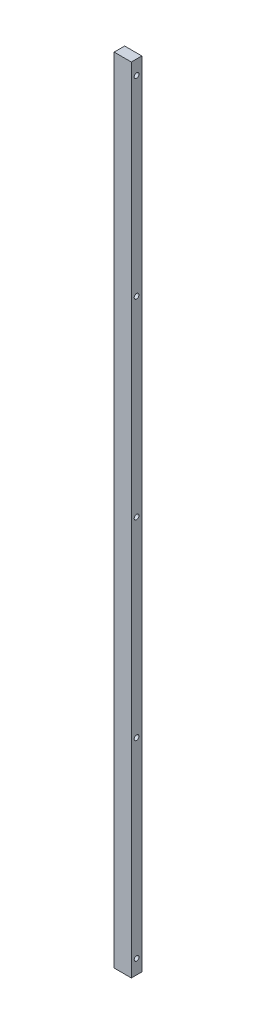
ISO-10303-21;
HEADER;
FILE_DESCRIPTION(('STEP AP214'),'2;1');
FILE_NAME('part.step','',(''),(''),'','','');
FILE_SCHEMA(('AUTOMOTIVE_DESIGN { 1 0 10303 214 1 1 1 1 }'));
ENDSEC;
DATA;
#1=APPLICATION_CONTEXT('core data for automotive mechanical design processes');
#2=APPLICATION_PROTOCOL_DEFINITION('international standard','automotive_design',2000,#1);
#3=PRODUCT_CONTEXT('',#1,'mechanical');
#4=PRODUCT('Part','Part','',(#3));
#5=PRODUCT_RELATED_PRODUCT_CATEGORY('part','',(#4));
#6=PRODUCT_DEFINITION_FORMATION('','',#4);
#7=PRODUCT_DEFINITION_CONTEXT('part definition',#1,'design');
#8=PRODUCT_DEFINITION('design','',#6,#7);
#9=PRODUCT_DEFINITION_SHAPE('','',#8);
#10=(LENGTH_UNIT() NAMED_UNIT(*) SI_UNIT(.MILLI.,.METRE.));
#11=(NAMED_UNIT(*) PLANE_ANGLE_UNIT() SI_UNIT($,.RADIAN.));
#12=(NAMED_UNIT(*) SI_UNIT($,.STERADIAN.) SOLID_ANGLE_UNIT());
#13=UNCERTAINTY_MEASURE_WITH_UNIT(LENGTH_MEASURE(1.E-05),#10,'distance_accuracy_value','');
#14=(GEOMETRIC_REPRESENTATION_CONTEXT(3) GLOBAL_UNCERTAINTY_ASSIGNED_CONTEXT((#13)) GLOBAL_UNIT_ASSIGNED_CONTEXT((#10,
#11,#12)) REPRESENTATION_CONTEXT('',''));
#15=CARTESIAN_POINT('',(0.,0.,0.));
#16=DIRECTION('',(0.,0.,1.));
#17=DIRECTION('',(1.,0.,0.));
#18=AXIS2_PLACEMENT_3D('',#15,#16,#17);
#19=CARTESIAN_POINT('',(9.,-415.,5.5));
#20=DIRECTION('',(-1.,0.,0.));
#21=DIRECTION('',(0.,0.,1.));
#22=AXIS2_PLACEMENT_3D('',#19,#20,#21);
#23=PLANE('',#22);
#24=CARTESIAN_POINT('',(9.,-400.,0.));
#25=DIRECTION('',(1.,0.,0.));
#26=DIRECTION('',(0.,0.,-1.));
#27=AXIS2_PLACEMENT_3D('',#24,#25,#26);
#28=CIRCLE('',#27,2.5);
#29=CARTESIAN_POINT('',(9.,-400.,-2.5));
#30=VERTEX_POINT('',#29);
#31=EDGE_CURVE('E124',#30,#30,#28,.T.);
#32=ORIENTED_EDGE('',*,*,#31,.F.);
#33=EDGE_LOOP('',(#32));
#34=FACE_BOUND('',#33,.T.);
#35=CARTESIAN_POINT('',(9.,-200.,0.));
#36=DIRECTION('',(1.,0.,0.));
#37=DIRECTION('',(0.,0.,-1.));
#38=AXIS2_PLACEMENT_3D('',#35,#36,#37);
#39=CIRCLE('',#38,2.5);
#40=CARTESIAN_POINT('',(9.,-200.,-2.50000000000003));
#41=VERTEX_POINT('',#40);
#42=EDGE_CURVE('E123',#41,#41,#39,.T.);
#43=ORIENTED_EDGE('',*,*,#42,.F.);
#44=EDGE_LOOP('',(#43));
#45=FACE_BOUND('',#44,.T.);
#46=CARTESIAN_POINT('',(9.,0.,0.));
#47=DIRECTION('',(1.,0.,0.));
#48=DIRECTION('',(0.,0.,-1.));
#49=AXIS2_PLACEMENT_3D('',#46,#47,#48);
#50=CIRCLE('',#49,2.49999999999999);
#51=CARTESIAN_POINT('',(9.,0.,-2.49999999999999));
#52=VERTEX_POINT('',#51);
#53=EDGE_CURVE('E134',#52,#52,#50,.T.);
#54=ORIENTED_EDGE('',*,*,#53,.F.);
#55=EDGE_LOOP('',(#54));
#56=FACE_BOUND('',#55,.T.);
#57=CARTESIAN_POINT('',(9.,200.,0.));
#58=DIRECTION('',(1.,0.,0.));
#59=DIRECTION('',(0.,0.,-1.));
#60=AXIS2_PLACEMENT_3D('',#57,#58,#59);
#61=CIRCLE('',#60,2.5);
#62=CARTESIAN_POINT('',(9.,200.,-2.50000000000003));
#63=VERTEX_POINT('',#62);
#64=EDGE_CURVE('E140',#63,#63,#61,.T.);
#65=ORIENTED_EDGE('',*,*,#64,.F.);
#66=EDGE_LOOP('',(#65));
#67=FACE_BOUND('',#66,.T.);
#68=CARTESIAN_POINT('',(9.,400.,0.));
#69=DIRECTION('',(1.,0.,0.));
#70=DIRECTION('',(0.,0.,-1.));
#71=AXIS2_PLACEMENT_3D('',#68,#69,#70);
#72=CIRCLE('',#71,2.5);
#73=CARTESIAN_POINT('',(9.,400.,-2.5));
#74=VERTEX_POINT('',#73);
#75=EDGE_CURVE('E146',#74,#74,#72,.T.);
#76=ORIENTED_EDGE('',*,*,#75,.F.);
#77=EDGE_LOOP('',(#76));
#78=FACE_BOUND('',#77,.T.);
#79=DIRECTION('',(0.,1.,0.));
#80=VECTOR('',#79,1.);
#81=CARTESIAN_POINT('',(9.,-415.,-5.5));
#82=LINE('',#81,#80);
#83=CARTESIAN_POINT('',(9.,-415.,-5.5));
#84=VERTEX_POINT('',#83);
#85=CARTESIAN_POINT('',(9.,415.,-5.5));
#86=VERTEX_POINT('',#85);
#87=EDGE_CURVE('E152',#84,#86,#82,.T.);
#88=ORIENTED_EDGE('',*,*,#87,.T.);
#89=DIRECTION('',(0.,0.,-1.));
#90=VECTOR('',#89,1.);
#91=CARTESIAN_POINT('',(9.,415.,5.5));
#92=LINE('',#91,#90);
#93=CARTESIAN_POINT('',(9.,415.,5.5));
#94=VERTEX_POINT('',#93);
#95=EDGE_CURVE('E13',#94,#86,#92,.T.);
#96=ORIENTED_EDGE('',*,*,#95,.F.);
#97=DIRECTION('',(0.,1.,0.));
#98=VECTOR('',#97,1.);
#99=CARTESIAN_POINT('',(9.,-415.,5.5));
#100=LINE('',#99,#98);
#101=CARTESIAN_POINT('',(9.,-415.,5.5));
#102=VERTEX_POINT('',#101);
#103=EDGE_CURVE('E153',#102,#94,#100,.T.);
#104=ORIENTED_EDGE('',*,*,#103,.F.);
#105=DIRECTION('',(0.,0.,-1.));
#106=VECTOR('',#105,1.);
#107=CARTESIAN_POINT('',(9.,-415.,5.5));
#108=LINE('',#107,#106);
#109=EDGE_CURVE('E159',#102,#84,#108,.T.);
#110=ORIENTED_EDGE('',*,*,#109,.T.);
#111=EDGE_LOOP('',(#88,#96,#104,#110));
#112=FACE_BOUND('',#111,.T.);
#113=ADVANCED_FACE('F50',(#34,#45,#56,#67,#78,#112),#23,.F.);
#114=CARTESIAN_POINT('',(-9.,415.,5.5));
#115=DIRECTION('',(0.,-1.,0.));
#116=DIRECTION('',(0.,0.,-1.));
#117=AXIS2_PLACEMENT_3D('',#114,#115,#116);
#118=PLANE('',#117);
#119=DIRECTION('',(-1.,0.,0.));
#120=VECTOR('',#119,1.);
#121=CARTESIAN_POINT('',(-9.,415.,-5.5));
#122=LINE('',#121,#120);
#123=CARTESIAN_POINT('',(-9.,415.,-5.5));
#124=VERTEX_POINT('',#123);
#125=EDGE_CURVE('E162',#86,#124,#122,.T.);
#126=ORIENTED_EDGE('',*,*,#125,.T.);
#127=DIRECTION('',(0.,0.,-1.));
#128=VECTOR('',#127,1.);
#129=CARTESIAN_POINT('',(-9.,415.,5.5));
#130=LINE('',#129,#128);
#131=CARTESIAN_POINT('',(-9.,415.,5.5));
#132=VERTEX_POINT('',#131);
#133=EDGE_CURVE('E58',#132,#124,#130,.T.);
#134=ORIENTED_EDGE('',*,*,#133,.F.);
#135=DIRECTION('',(-1.,0.,0.));
#136=VECTOR('',#135,1.);
#137=CARTESIAN_POINT('',(-9.,415.,5.5));
#138=LINE('',#137,#136);
#139=EDGE_CURVE('E97',#94,#132,#138,.T.);
#140=ORIENTED_EDGE('',*,*,#139,.F.);
#141=ORIENTED_EDGE('',*,*,#95,.T.);
#142=EDGE_LOOP('',(#126,#134,#140,#141));
#143=FACE_BOUND('',#142,.T.);
#144=ADVANCED_FACE('F185',(#143),#118,.F.);
#145=CARTESIAN_POINT('',(-9.,-415.,5.5));
#146=DIRECTION('',(1.,0.,0.));
#147=DIRECTION('',(0.,0.,-1.));
#148=AXIS2_PLACEMENT_3D('',#145,#146,#147);
#149=PLANE('',#148);
#150=DIRECTION('',(0.,-1.,0.));
#151=VECTOR('',#150,1.);
#152=CARTESIAN_POINT('',(-9.,-415.,-5.5));
#153=LINE('',#152,#151);
#154=CARTESIAN_POINT('',(-9.,-415.,-5.5));
#155=VERTEX_POINT('',#154);
#156=EDGE_CURVE('E84',#124,#155,#153,.T.);
#157=ORIENTED_EDGE('',*,*,#156,.T.);
#158=DIRECTION('',(0.,0.,-1.));
#159=VECTOR('',#158,1.);
#160=CARTESIAN_POINT('',(-9.,-415.,5.5));
#161=LINE('',#160,#159);
#162=CARTESIAN_POINT('',(-9.,-415.,5.5));
#163=VERTEX_POINT('',#162);
#164=EDGE_CURVE('E167',#163,#155,#161,.T.);
#165=ORIENTED_EDGE('',*,*,#164,.F.);
#166=DIRECTION('',(0.,-1.,0.));
#167=VECTOR('',#166,1.);
#168=CARTESIAN_POINT('',(-9.,-415.,5.5));
#169=LINE('',#168,#167);
#170=EDGE_CURVE('E156',#132,#163,#169,.T.);
#171=ORIENTED_EDGE('',*,*,#170,.F.);
#172=ORIENTED_EDGE('',*,*,#133,.T.);
#173=EDGE_LOOP('',(#157,#165,#171,#172));
#174=FACE_BOUND('',#173,.T.);
#175=ADVANCED_FACE('F169',(#174),#149,.F.);
#176=CARTESIAN_POINT('',(-9.,-415.,5.5));
#177=DIRECTION('',(0.,1.,0.));
#178=DIRECTION('',(0.,0.,1.));
#179=AXIS2_PLACEMENT_3D('',#176,#177,#178);
#180=PLANE('',#179);
#181=DIRECTION('',(1.,0.,0.));
#182=VECTOR('',#181,1.);
#183=CARTESIAN_POINT('',(-9.,-415.,-5.5));
#184=LINE('',#183,#182);
#185=EDGE_CURVE('E90',#155,#84,#184,.T.);
#186=ORIENTED_EDGE('',*,*,#185,.T.);
#187=ORIENTED_EDGE('',*,*,#109,.F.);
#188=DIRECTION('',(1.,0.,0.));
#189=VECTOR('',#188,1.);
#190=CARTESIAN_POINT('',(-9.,-415.,5.5));
#191=LINE('',#190,#189);
#192=EDGE_CURVE('E66',#163,#102,#191,.T.);
#193=ORIENTED_EDGE('',*,*,#192,.F.);
#194=ORIENTED_EDGE('',*,*,#164,.T.);
#195=EDGE_LOOP('',(#186,#187,#193,#194));
#196=FACE_BOUND('',#195,.T.);
#197=ADVANCED_FACE('F176',(#196),#180,.F.);
#198=CARTESIAN_POINT('',(0.,0.,5.5));
#199=DIRECTION('',(0.,0.,-1.));
#200=DIRECTION('',(-1.,0.,0.));
#201=AXIS2_PLACEMENT_3D('',#198,#199,#200);
#202=PLANE('',#201);
#203=ORIENTED_EDGE('',*,*,#103,.T.);
#204=ORIENTED_EDGE('',*,*,#139,.T.);
#205=ORIENTED_EDGE('',*,*,#170,.T.);
#206=ORIENTED_EDGE('',*,*,#192,.T.);
#207=EDGE_LOOP('',(#203,#204,#205,#206));
#208=FACE_BOUND('',#207,.T.);
#209=ADVANCED_FACE('F178',(#208),#202,.F.);
#210=CARTESIAN_POINT('',(0.,0.,-5.5));
#211=DIRECTION('',(0.,0.,-1.));
#212=DIRECTION('',(-1.,0.,0.));
#213=AXIS2_PLACEMENT_3D('',#210,#211,#212);
#214=PLANE('',#213);
#215=ORIENTED_EDGE('',*,*,#87,.F.);
#216=ORIENTED_EDGE('',*,*,#185,.F.);
#217=ORIENTED_EDGE('',*,*,#156,.F.);
#218=ORIENTED_EDGE('',*,*,#125,.F.);
#219=EDGE_LOOP('',(#215,#216,#217,#218));
#220=FACE_BOUND('',#219,.T.);
#221=ADVANCED_FACE('F172',(#220),#214,.T.);
#222=CARTESIAN_POINT('',(-6.,400.,0.));
#223=DIRECTION('',(1.,0.,0.));
#224=DIRECTION('',(0.,0.,-1.));
#225=AXIS2_PLACEMENT_3D('',#222,#223,#224);
#226=CONICAL_SURFACE('',#225,2.5,1.02974425867666);
#227=CARTESIAN_POINT('',(-7.5021515475689,400.,0.));
#228=VERTEX_POINT('',#227);
#229=VERTEX_LOOP('',#228);
#230=FACE_BOUND('',#229,.T.);
#231=CARTESIAN_POINT('',(-6.,400.,0.));
#232=DIRECTION('',(1.,0.,0.));
#233=DIRECTION('',(0.,0.,-1.));
#234=AXIS2_PLACEMENT_3D('',#231,#232,#233);
#235=CIRCLE('',#234,2.5);
#236=CARTESIAN_POINT('',(-6.,400.,-2.5));
#237=VERTEX_POINT('',#236);
#238=EDGE_CURVE('E149',#237,#237,#235,.T.);
#239=ORIENTED_EDGE('',*,*,#238,.T.);
#240=EDGE_LOOP('',(#239));
#241=FACE_BOUND('',#240,.T.);
#242=ADVANCED_FACE('F206',(#230,#241),#226,.F.);
#243=CARTESIAN_POINT('',(9.,400.,0.));
#244=DIRECTION('',(1.,0.,0.));
#245=DIRECTION('',(0.,0.,-1.));
#246=AXIS2_PLACEMENT_3D('',#243,#244,#245);
#247=CYLINDRICAL_SURFACE('',#246,2.5);
#248=ORIENTED_EDGE('',*,*,#238,.F.);
#249=EDGE_LOOP('',(#248));
#250=FACE_BOUND('',#249,.T.);
#251=ORIENTED_EDGE('',*,*,#75,.T.);
#252=EDGE_LOOP('',(#251));
#253=FACE_BOUND('',#252,.T.);
#254=ADVANCED_FACE('F203',(#250,#253),#247,.F.);
#255=CARTESIAN_POINT('',(-6.,200.,0.));
#256=DIRECTION('',(1.,0.,0.));
#257=DIRECTION('',(0.,0.,-1.));
#258=AXIS2_PLACEMENT_3D('',#255,#256,#257);
#259=CONICAL_SURFACE('',#258,2.49999999999997,1.02974425867665);
#260=CARTESIAN_POINT('',(-7.5021515475689,200.,0.));
#261=VERTEX_POINT('',#260);
#262=VERTEX_LOOP('',#261);
#263=FACE_BOUND('',#262,.T.);
#264=CARTESIAN_POINT('',(-6.,200.,0.));
#265=DIRECTION('',(1.,0.,0.));
#266=DIRECTION('',(0.,0.,-1.));
#267=AXIS2_PLACEMENT_3D('',#264,#265,#266);
#268=CIRCLE('',#267,2.49999999999997);
#269=CARTESIAN_POINT('',(-6.,200.,-2.5));
#270=VERTEX_POINT('',#269);
#271=EDGE_CURVE('E143',#270,#270,#268,.T.);
#272=ORIENTED_EDGE('',*,*,#271,.T.);
#273=EDGE_LOOP('',(#272));
#274=FACE_BOUND('',#273,.T.);
#275=ADVANCED_FACE('F205',(#263,#274),#259,.F.);
#276=CARTESIAN_POINT('',(9.,200.,0.));
#277=DIRECTION('',(1.,0.,0.));
#278=DIRECTION('',(0.,0.,-1.));
#279=AXIS2_PLACEMENT_3D('',#276,#277,#278);
#280=CYLINDRICAL_SURFACE('',#279,2.49999999999999);
#281=ORIENTED_EDGE('',*,*,#271,.F.);
#282=EDGE_LOOP('',(#281));
#283=FACE_BOUND('',#282,.T.);
#284=ORIENTED_EDGE('',*,*,#64,.T.);
#285=EDGE_LOOP('',(#284));
#286=FACE_BOUND('',#285,.T.);
#287=ADVANCED_FACE('F213',(#283,#286),#280,.F.);
#288=CARTESIAN_POINT('',(-6.,0.,0.));
#289=DIRECTION('',(1.,0.,0.));
#290=DIRECTION('',(0.,0.,-1.));
#291=AXIS2_PLACEMENT_3D('',#288,#289,#290);
#292=CONICAL_SURFACE('',#291,2.49999999999999,1.02974425867665);
#293=CARTESIAN_POINT('',(-7.5021515475689,0.,0.));
#294=VERTEX_POINT('',#293);
#295=VERTEX_LOOP('',#294);
#296=FACE_BOUND('',#295,.T.);
#297=CARTESIAN_POINT('',(-6.,0.,0.));
#298=DIRECTION('',(1.,0.,0.));
#299=DIRECTION('',(0.,0.,-1.));
#300=AXIS2_PLACEMENT_3D('',#297,#298,#299);
#301=CIRCLE('',#300,2.49999999999999);
#302=CARTESIAN_POINT('',(-6.,0.,-2.49999999999999));
#303=VERTEX_POINT('',#302);
#304=EDGE_CURVE('E137',#303,#303,#301,.T.);
#305=ORIENTED_EDGE('',*,*,#304,.T.);
#306=EDGE_LOOP('',(#305));
#307=FACE_BOUND('',#306,.T.);
#308=ADVANCED_FACE('F254',(#296,#307),#292,.F.);
#309=CARTESIAN_POINT('',(9.,0.,0.));
#310=DIRECTION('',(1.,0.,0.));
#311=DIRECTION('',(0.,0.,-1.));
#312=AXIS2_PLACEMENT_3D('',#309,#310,#311);
#313=CYLINDRICAL_SURFACE('',#312,2.49999999999999);
#314=ORIENTED_EDGE('',*,*,#304,.F.);
#315=EDGE_LOOP('',(#314));
#316=FACE_BOUND('',#315,.T.);
#317=ORIENTED_EDGE('',*,*,#53,.T.);
#318=EDGE_LOOP('',(#317));
#319=FACE_BOUND('',#318,.T.);
#320=ADVANCED_FACE('F265',(#316,#319),#313,.F.);
#321=CARTESIAN_POINT('',(-6.,-200.,0.));
#322=DIRECTION('',(1.,0.,0.));
#323=DIRECTION('',(0.,0.,-1.));
#324=AXIS2_PLACEMENT_3D('',#321,#322,#323);
#325=CONICAL_SURFACE('',#324,2.49999999999997,1.02974425867665);
#326=CARTESIAN_POINT('',(-7.5021515475689,-200.,0.));
#327=VERTEX_POINT('',#326);
#328=VERTEX_LOOP('',#327);
#329=FACE_BOUND('',#328,.T.);
#330=CARTESIAN_POINT('',(-6.,-200.,0.));
#331=DIRECTION('',(1.,0.,0.));
#332=DIRECTION('',(0.,0.,-1.));
#333=AXIS2_PLACEMENT_3D('',#330,#331,#332);
#334=CIRCLE('',#333,2.49999999999997);
#335=CARTESIAN_POINT('',(-6.,-200.,-2.5));
#336=VERTEX_POINT('',#335);
#337=EDGE_CURVE('E127',#336,#336,#334,.T.);
#338=ORIENTED_EDGE('',*,*,#337,.T.);
#339=EDGE_LOOP('',(#338));
#340=FACE_BOUND('',#339,.T.);
#341=ADVANCED_FACE('F275',(#329,#340),#325,.F.);
#342=CARTESIAN_POINT('',(9.,-200.,0.));
#343=DIRECTION('',(1.,0.,0.));
#344=DIRECTION('',(0.,0.,-1.));
#345=AXIS2_PLACEMENT_3D('',#342,#343,#344);
#346=CYLINDRICAL_SURFACE('',#345,2.49999999999999);
#347=ORIENTED_EDGE('',*,*,#337,.F.);
#348=EDGE_LOOP('',(#347));
#349=FACE_BOUND('',#348,.T.);
#350=ORIENTED_EDGE('',*,*,#42,.T.);
#351=EDGE_LOOP('',(#350));
#352=FACE_BOUND('',#351,.T.);
#353=ADVANCED_FACE('F117',(#349,#352),#346,.F.);
#354=CARTESIAN_POINT('',(-6.,-400.,0.));
#355=DIRECTION('',(1.,0.,0.));
#356=DIRECTION('',(0.,0.,-1.));
#357=AXIS2_PLACEMENT_3D('',#354,#355,#356);
#358=CONICAL_SURFACE('',#357,2.5,1.02974425867666);
#359=CARTESIAN_POINT('',(-7.5021515475689,-400.,0.));
#360=VERTEX_POINT('',#359);
#361=VERTEX_LOOP('',#360);
#362=FACE_BOUND('',#361,.T.);
#363=CARTESIAN_POINT('',(-6.,-400.,0.));
#364=DIRECTION('',(1.,0.,0.));
#365=DIRECTION('',(0.,0.,-1.));
#366=AXIS2_PLACEMENT_3D('',#363,#364,#365);
#367=CIRCLE('',#366,2.5);
#368=CARTESIAN_POINT('',(-6.,-400.,-2.5));
#369=VERTEX_POINT('',#368);
#370=EDGE_CURVE('E121',#369,#369,#367,.T.);
#371=ORIENTED_EDGE('',*,*,#370,.T.);
#372=EDGE_LOOP('',(#371));
#373=FACE_BOUND('',#372,.T.);
#374=ADVANCED_FACE('F113',(#362,#373),#358,.F.);
#375=CARTESIAN_POINT('',(9.,-400.,0.));
#376=DIRECTION('',(1.,0.,0.));
#377=DIRECTION('',(0.,0.,-1.));
#378=AXIS2_PLACEMENT_3D('',#375,#376,#377);
#379=CYLINDRICAL_SURFACE('',#378,2.5);
#380=ORIENTED_EDGE('',*,*,#370,.F.);
#381=EDGE_LOOP('',(#380));
#382=FACE_BOUND('',#381,.T.);
#383=ORIENTED_EDGE('',*,*,#31,.T.);
#384=EDGE_LOOP('',(#383));
#385=FACE_BOUND('',#384,.T.);
#386=ADVANCED_FACE('F116',(#382,#385),#379,.F.);
#387=CLOSED_SHELL('',(#113,#144,#175,#197,#209,#221,#242,#254,#275,#287,#308,#320,#341,#353,
#374,#386));
#388=MANIFOLD_SOLID_BREP('B2',#387);
#389=ADVANCED_BREP_SHAPE_REPRESENTATION('',(#18,#388),#14);
#390=SHAPE_DEFINITION_REPRESENTATION(#9,#389);
ENDSEC;
END-ISO-10303-21;
